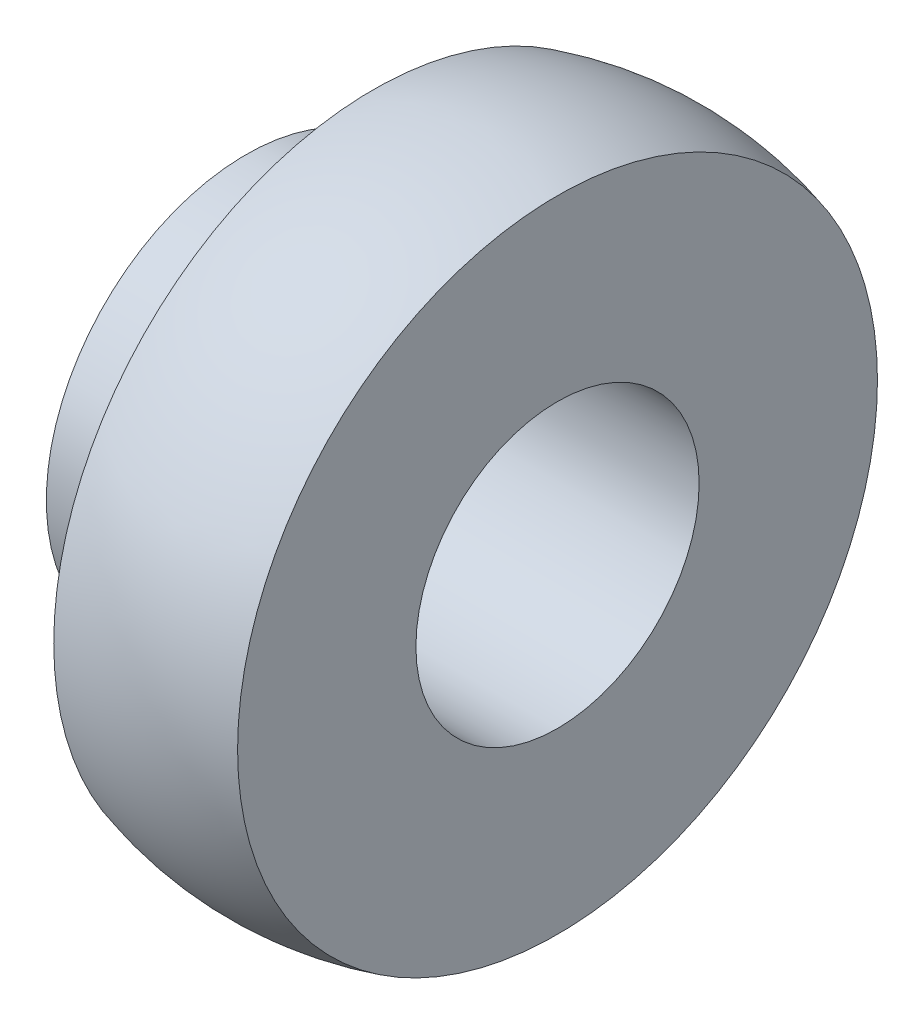
ISO-10303-21;
HEADER;
FILE_DESCRIPTION(('STEP AP214'),'2;1');
FILE_NAME('part.step','',(''),(''),'','','');
FILE_SCHEMA(('AUTOMOTIVE_DESIGN { 1 0 10303 214 1 1 1 1 }'));
ENDSEC;
DATA;
#1=APPLICATION_CONTEXT('core data for automotive mechanical design processes');
#2=APPLICATION_PROTOCOL_DEFINITION('international standard','automotive_design',2000,#1);
#3=PRODUCT_CONTEXT('',#1,'mechanical');
#4=PRODUCT('Part','Part','',(#3));
#5=PRODUCT_RELATED_PRODUCT_CATEGORY('part','',(#4));
#6=PRODUCT_DEFINITION_FORMATION('','',#4);
#7=PRODUCT_DEFINITION_CONTEXT('part definition',#1,'design');
#8=PRODUCT_DEFINITION('design','',#6,#7);
#9=PRODUCT_DEFINITION_SHAPE('','',#8);
#10=(LENGTH_UNIT() NAMED_UNIT(*) SI_UNIT(.MILLI.,.METRE.));
#11=(NAMED_UNIT(*) PLANE_ANGLE_UNIT() SI_UNIT($,.RADIAN.));
#12=(NAMED_UNIT(*) SI_UNIT($,.STERADIAN.) SOLID_ANGLE_UNIT());
#13=UNCERTAINTY_MEASURE_WITH_UNIT(LENGTH_MEASURE(1.E-05),#10,'distance_accuracy_value','');
#14=(GEOMETRIC_REPRESENTATION_CONTEXT(3) GLOBAL_UNCERTAINTY_ASSIGNED_CONTEXT((#13)) GLOBAL_UNIT_ASSIGNED_CONTEXT((#10,
#11,#12)) REPRESENTATION_CONTEXT('',''));
#15=CARTESIAN_POINT('',(0.,0.,0.));
#16=DIRECTION('',(0.,0.,1.));
#17=DIRECTION('',(1.,0.,0.));
#18=AXIS2_PLACEMENT_3D('',#15,#16,#17);
#19=CARTESIAN_POINT('',(-6.53239177112806,0.,0.));
#20=DIRECTION('',(-1.,0.,0.));
#21=DIRECTION('',(0.,0.,1.));
#22=AXIS2_PLACEMENT_3D('',#19,#20,#21);
#23=PLANE('',#22);
#24=CARTESIAN_POINT('',(-6.53239177112806,0.,0.));
#25=DIRECTION('',(1.,0.,0.));
#26=DIRECTION('',(0.,0.,-1.));
#27=AXIS2_PLACEMENT_3D('',#24,#25,#26);
#28=CIRCLE('',#27,14.1);
#29=CARTESIAN_POINT('',(-6.53239177112806,0.,-14.1));
#30=VERTEX_POINT('',#29);
#31=EDGE_CURVE('E52',#30,#30,#28,.T.);
#32=ORIENTED_EDGE('',*,*,#31,.T.);
#33=EDGE_LOOP('',(#32));
#34=FACE_BOUND('',#33,.T.);
#35=CARTESIAN_POINT('',(-6.53239177112806,0.,0.));
#36=DIRECTION('',(1.,0.,0.));
#37=DIRECTION('',(0.,0.,-1.));
#38=AXIS2_PLACEMENT_3D('',#35,#36,#37);
#39=CIRCLE('',#38,22.573831259857);
#40=CARTESIAN_POINT('',(-6.53239177112806,0.,-22.573831259857));
#41=VERTEX_POINT('',#40);
#42=EDGE_CURVE('E10',#41,#41,#39,.T.);
#43=ORIENTED_EDGE('',*,*,#42,.F.);
#44=EDGE_LOOP('',(#43));
#45=FACE_BOUND('',#44,.T.);
#46=ADVANCED_FACE('F30',(#34,#45),#23,.T.);
#47=CARTESIAN_POINT('',(0.,0.,0.));
#48=DIRECTION('',(1.,0.,0.));
#49=DIRECTION('',(0.,0.,1.));
#50=AXIS2_PLACEMENT_3D('',#47,#48,#49);
#51=SPHERICAL_SURFACE('',#50,23.5);
#52=CARTESIAN_POINT('',(6.46760822887193,0.,0.));
#53=DIRECTION('',(1.,0.,0.));
#54=DIRECTION('',(0.,0.,-1.));
#55=AXIS2_PLACEMENT_3D('',#52,#53,#54);
#56=CIRCLE('',#55,22.5924775931687);
#57=CARTESIAN_POINT('',(6.46760822887193,0.,-22.5924775931687));
#58=VERTEX_POINT('',#57);
#59=EDGE_CURVE('E36',#58,#58,#56,.T.);
#60=ORIENTED_EDGE('',*,*,#59,.F.);
#61=EDGE_LOOP('',(#60));
#62=FACE_BOUND('',#61,.T.);
#63=ORIENTED_EDGE('',*,*,#42,.T.);
#64=EDGE_LOOP('',(#63));
#65=FACE_BOUND('',#64,.T.);
#66=ADVANCED_FACE('F78',(#62,#65),#51,.T.);
#67=CARTESIAN_POINT('',(6.46760822887193,0.,0.));
#68=DIRECTION('',(-1.,0.,0.));
#69=DIRECTION('',(0.,0.,1.));
#70=AXIS2_PLACEMENT_3D('',#67,#68,#69);
#71=PLANE('',#70);
#72=CARTESIAN_POINT('',(6.46760822887193,0.,0.));
#73=DIRECTION('',(1.,0.,0.));
#74=DIRECTION('',(0.,0.,-1.));
#75=AXIS2_PLACEMENT_3D('',#72,#73,#74);
#76=CIRCLE('',#75,10.);
#77=CARTESIAN_POINT('',(6.46760822887193,0.,-10.));
#78=VERTEX_POINT('',#77);
#79=EDGE_CURVE('E40',#78,#78,#76,.T.);
#80=ORIENTED_EDGE('',*,*,#79,.F.);
#81=EDGE_LOOP('',(#80));
#82=FACE_BOUND('',#81,.T.);
#83=ORIENTED_EDGE('',*,*,#59,.T.);
#84=EDGE_LOOP('',(#83));
#85=FACE_BOUND('',#84,.T.);
#86=ADVANCED_FACE('F73',(#82,#85),#71,.F.);
#87=CARTESIAN_POINT('',(6.47013667845208,0.,0.));
#88=DIRECTION('',(1.,0.,0.));
#89=DIRECTION('',(0.,0.,-1.));
#90=AXIS2_PLACEMENT_3D('',#87,#88,#89);
#91=CYLINDRICAL_SURFACE('',#90,10.);
#92=CARTESIAN_POINT('',(-15.5293127139158,0.,0.));
#93=DIRECTION('',(1.,0.,0.));
#94=DIRECTION('',(0.,0.,-1.));
#95=AXIS2_PLACEMENT_3D('',#92,#93,#94);
#96=CIRCLE('',#95,10.);
#97=CARTESIAN_POINT('',(-15.5293127139158,0.,-10.));
#98=VERTEX_POINT('',#97);
#99=EDGE_CURVE('E44',#98,#98,#96,.T.);
#100=ORIENTED_EDGE('',*,*,#99,.F.);
#101=EDGE_LOOP('',(#100));
#102=FACE_BOUND('',#101,.T.);
#103=ORIENTED_EDGE('',*,*,#79,.T.);
#104=EDGE_LOOP('',(#103));
#105=FACE_BOUND('',#104,.T.);
#106=ADVANCED_FACE('F67',(#102,#105),#91,.F.);
#107=CARTESIAN_POINT('',(-15.5293127139158,0.,0.));
#108=DIRECTION('',(1.,0.,0.));
#109=DIRECTION('',(0.,0.,-1.));
#110=AXIS2_PLACEMENT_3D('',#107,#108,#109);
#111=PLANE('',#110);
#112=CARTESIAN_POINT('',(-15.5293127139158,0.,0.));
#113=DIRECTION('',(1.,0.,0.));
#114=DIRECTION('',(0.,0.,-1.));
#115=AXIS2_PLACEMENT_3D('',#112,#113,#114);
#116=CIRCLE('',#115,14.1);
#117=CARTESIAN_POINT('',(-15.5293127139158,0.,-14.1));
#118=VERTEX_POINT('',#117);
#119=EDGE_CURVE('E49',#118,#118,#116,.T.);
#120=ORIENTED_EDGE('',*,*,#119,.F.);
#121=EDGE_LOOP('',(#120));
#122=FACE_BOUND('',#121,.T.);
#123=ORIENTED_EDGE('',*,*,#99,.T.);
#124=EDGE_LOOP('',(#123));
#125=FACE_BOUND('',#124,.T.);
#126=ADVANCED_FACE('F61',(#122,#125),#111,.F.);
#127=CARTESIAN_POINT('',(6.47013667845208,0.,0.));
#128=DIRECTION('',(1.,0.,0.));
#129=DIRECTION('',(0.,0.,-1.));
#130=AXIS2_PLACEMENT_3D('',#127,#128,#129);
#131=CYLINDRICAL_SURFACE('',#130,14.1);
#132=ORIENTED_EDGE('',*,*,#31,.F.);
#133=EDGE_LOOP('',(#132));
#134=FACE_BOUND('',#133,.T.);
#135=ORIENTED_EDGE('',*,*,#119,.T.);
#136=EDGE_LOOP('',(#135));
#137=FACE_BOUND('',#136,.T.);
#138=ADVANCED_FACE('F58',(#134,#137),#131,.T.);
#139=CLOSED_SHELL('',(#46,#66,#86,#106,#126,#138));
#140=MANIFOLD_SOLID_BREP('B2',#139);
#141=ADVANCED_BREP_SHAPE_REPRESENTATION('',(#18,#140),#14);
#142=SHAPE_DEFINITION_REPRESENTATION(#9,#141);
ENDSEC;
END-ISO-10303-21;
